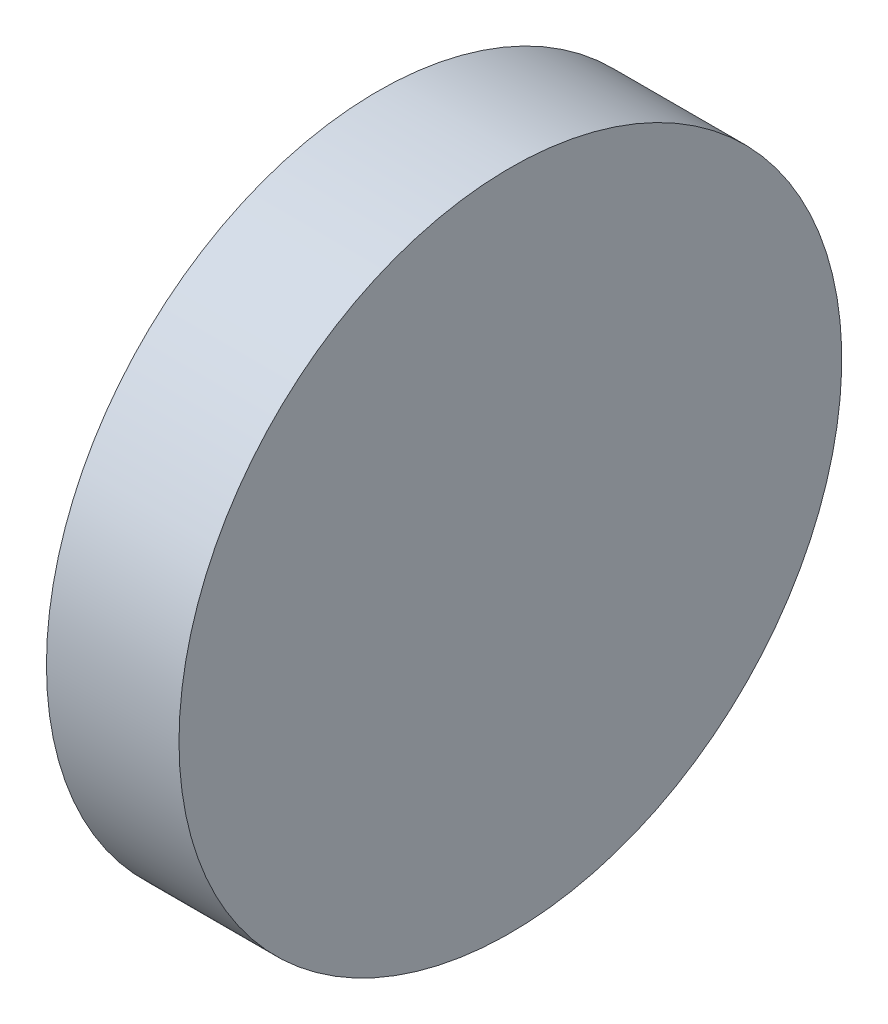
ISO-10303-21;
HEADER;
FILE_DESCRIPTION(('STEP AP214'),'2;1');
FILE_NAME('part.step','',(''),(''),'','','');
FILE_SCHEMA(('AUTOMOTIVE_DESIGN { 1 0 10303 214 1 1 1 1 }'));
ENDSEC;
DATA;
#1=APPLICATION_CONTEXT('core data for automotive mechanical design processes');
#2=APPLICATION_PROTOCOL_DEFINITION('international standard','automotive_design',2000,#1);
#3=PRODUCT_CONTEXT('',#1,'mechanical');
#4=PRODUCT('Part','Part','',(#3));
#5=PRODUCT_RELATED_PRODUCT_CATEGORY('part','',(#4));
#6=PRODUCT_DEFINITION_FORMATION('','',#4);
#7=PRODUCT_DEFINITION_CONTEXT('part definition',#1,'design');
#8=PRODUCT_DEFINITION('design','',#6,#7);
#9=PRODUCT_DEFINITION_SHAPE('','',#8);
#10=(LENGTH_UNIT() NAMED_UNIT(*) SI_UNIT(.MILLI.,.METRE.));
#11=(NAMED_UNIT(*) PLANE_ANGLE_UNIT() SI_UNIT($,.RADIAN.));
#12=(NAMED_UNIT(*) SI_UNIT($,.STERADIAN.) SOLID_ANGLE_UNIT());
#13=UNCERTAINTY_MEASURE_WITH_UNIT(LENGTH_MEASURE(1.E-05),#10,'distance_accuracy_value','');
#14=(GEOMETRIC_REPRESENTATION_CONTEXT(3) GLOBAL_UNCERTAINTY_ASSIGNED_CONTEXT((#13)) GLOBAL_UNIT_ASSIGNED_CONTEXT((#10,
#11,#12)) REPRESENTATION_CONTEXT('',''));
#15=CARTESIAN_POINT('',(0.,0.,0.));
#16=DIRECTION('',(0.,0.,1.));
#17=DIRECTION('',(1.,0.,0.));
#18=AXIS2_PLACEMENT_3D('',#15,#16,#17);
#19=CARTESIAN_POINT('',(256.884904082811,77.311360012424,0.));
#20=DIRECTION('',(1.,0.,0.));
#21=DIRECTION('',(0.,0.,-1.));
#22=AXIS2_PLACEMENT_3D('',#19,#20,#21);
#23=PLANE('',#22);
#24=CARTESIAN_POINT('',(256.884904082811,77.311360012424,0.));
#25=DIRECTION('',(-1.,0.,0.));
#26=DIRECTION('',(0.,0.,1.));
#27=AXIS2_PLACEMENT_3D('',#24,#25,#26);
#28=CIRCLE('',#27,15.);
#29=CARTESIAN_POINT('',(256.884904082811,77.311360012424,15.));
#30=VERTEX_POINT('',#29);
#31=EDGE_CURVE('E10',#30,#30,#28,.T.);
#32=ORIENTED_EDGE('',*,*,#31,.T.);
#33=EDGE_LOOP('',(#32));
#34=FACE_BOUND('',#33,.T.);
#35=ADVANCED_FACE('F35',(#34),#23,.F.);
#36=CARTESIAN_POINT('',(251.374901690653,77.311360012424,0.));
#37=DIRECTION('',(-1.,0.,0.));
#38=DIRECTION('',(0.,0.,1.));
#39=AXIS2_PLACEMENT_3D('',#36,#37,#38);
#40=CYLINDRICAL_SURFACE('',#39,15.);
#41=ORIENTED_EDGE('',*,*,#31,.F.);
#42=EDGE_LOOP('',(#41));
#43=FACE_BOUND('',#42,.T.);
#44=CARTESIAN_POINT('',(262.884904082811,77.311360012424,0.));
#45=DIRECTION('',(-1.,0.,0.));
#46=DIRECTION('',(0.,0.,1.));
#47=AXIS2_PLACEMENT_3D('',#44,#45,#46);
#48=CIRCLE('',#47,15.);
#49=CARTESIAN_POINT('',(262.884904082811,77.311360012424,15.));
#50=VERTEX_POINT('',#49);
#51=EDGE_CURVE('E41',#50,#50,#48,.T.);
#52=ORIENTED_EDGE('',*,*,#51,.T.);
#53=EDGE_LOOP('',(#52));
#54=FACE_BOUND('',#53,.T.);
#55=ADVANCED_FACE('F47',(#43,#54),#40,.T.);
#56=CARTESIAN_POINT('',(262.884904082811,92.311360012424,0.));
#57=DIRECTION('',(-1.,0.,0.));
#58=DIRECTION('',(0.,0.,1.));
#59=AXIS2_PLACEMENT_3D('',#56,#57,#58);
#60=PLANE('',#59);
#61=ORIENTED_EDGE('',*,*,#51,.F.);
#62=EDGE_LOOP('',(#61));
#63=FACE_BOUND('',#62,.T.);
#64=ADVANCED_FACE('F49',(#63),#60,.F.);
#65=CLOSED_SHELL('',(#35,#55,#64));
#66=MANIFOLD_SOLID_BREP('B2',#65);
#67=ADVANCED_BREP_SHAPE_REPRESENTATION('',(#18,#66),#14);
#68=SHAPE_DEFINITION_REPRESENTATION(#9,#67);
ENDSEC;
END-ISO-10303-21;
